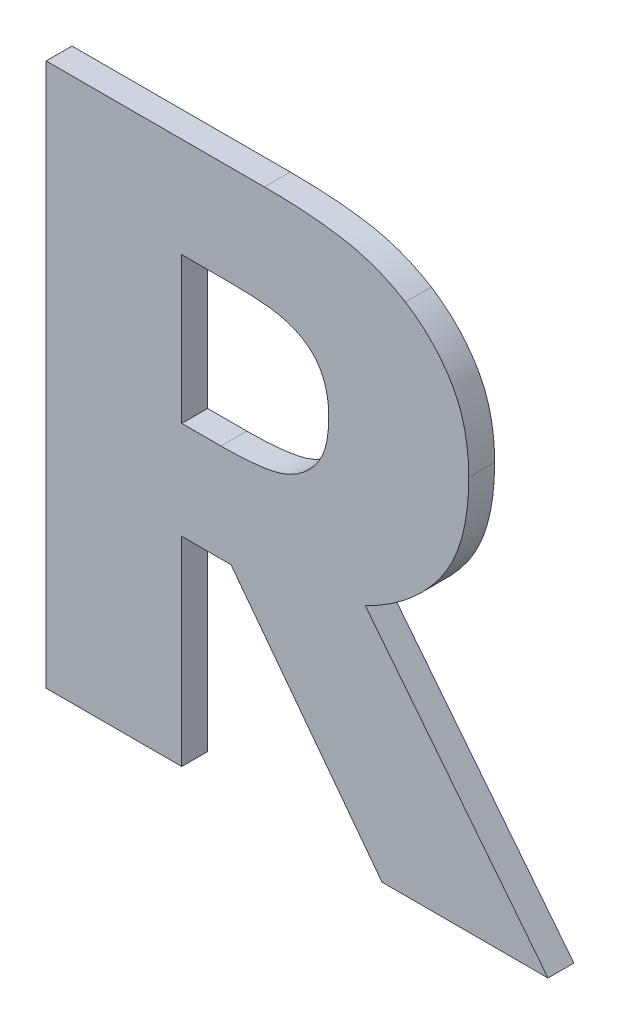
ISO-10303-21;
HEADER;
FILE_DESCRIPTION(('STEP AP214'),'2;1');
FILE_NAME('part.step','',(''),(''),'','','');
FILE_SCHEMA(('AUTOMOTIVE_DESIGN { 1 0 10303 214 1 1 1 1 }'));
ENDSEC;
DATA;
#1=APPLICATION_CONTEXT('core data for automotive mechanical design processes');
#2=APPLICATION_PROTOCOL_DEFINITION('international standard','automotive_design',2000,#1);
#3=PRODUCT_CONTEXT('',#1,'mechanical');
#4=PRODUCT('Part','Part','',(#3));
#5=PRODUCT_RELATED_PRODUCT_CATEGORY('part','',(#4));
#6=PRODUCT_DEFINITION_FORMATION('','',#4);
#7=PRODUCT_DEFINITION_CONTEXT('part definition',#1,'design');
#8=PRODUCT_DEFINITION('design','',#6,#7);
#9=PRODUCT_DEFINITION_SHAPE('','',#8);
#10=(LENGTH_UNIT() NAMED_UNIT(*) SI_UNIT(.MILLI.,.METRE.));
#11=(NAMED_UNIT(*) PLANE_ANGLE_UNIT() SI_UNIT($,.RADIAN.));
#12=(NAMED_UNIT(*) SI_UNIT($,.STERADIAN.) SOLID_ANGLE_UNIT());
#13=UNCERTAINTY_MEASURE_WITH_UNIT(LENGTH_MEASURE(1.E-05),#10,'distance_accuracy_value','');
#14=(GEOMETRIC_REPRESENTATION_CONTEXT(3) GLOBAL_UNCERTAINTY_ASSIGNED_CONTEXT((#13)) GLOBAL_UNIT_ASSIGNED_CONTEXT((#10,
#11,#12)) REPRESENTATION_CONTEXT('',''));
#15=CARTESIAN_POINT('',(0.,0.,0.));
#16=DIRECTION('',(0.,0.,1.));
#17=DIRECTION('',(1.,0.,0.));
#18=AXIS2_PLACEMENT_3D('',#15,#16,#17);
#19=CARTESIAN_POINT('',(3.8390123868986,-3.1245842210898,0.0475));
#20=CARTESIAN_POINT('',(3.8390123868986,-3.1245842210898,0.0525));
#21=CARTESIAN_POINT('',(3.8415650610491,-3.1225420817694,0.0475));
#22=CARTESIAN_POINT('',(3.8415650610491,-3.1225420817694,0.0525));
#23=CARTESIAN_POINT('',(3.8440326460612,-3.1170963769151,0.0475));
#24=CARTESIAN_POINT('',(3.8440326460612,-3.1170963769151,0.0525));
#25=CARTESIAN_POINT('',(3.8440326460612,-3.112671741721,0.0475));
#26=CARTESIAN_POINT('',(3.8440326460612,-3.112671741721,0.0525));
#27=B_SPLINE_SURFACE_WITH_KNOTS('',2,1,((#19,#20),(#21,#22),(#23,#24),(#25,#26)),.UNSPECIFIED.,
.F.,.F.,.F.,(3,1,3),(2,2),(0.,1.,2.),(0.,0.01),.UNSPECIFIED.);
#28=CARTESIAN_POINT('',(3.8390123868986,-3.1245842210898,0.0475));
#29=CARTESIAN_POINT('',(3.8415650610491,-3.1225420817694,0.0475));
#30=CARTESIAN_POINT('',(3.8440326460612,-3.1170963769151,0.0475));
#31=CARTESIAN_POINT('',(3.8440326460612,-3.112671741721,0.0475));
#32=B_SPLINE_CURVE_WITH_KNOTS('',2,(#28,#29,#30,#31),.UNSPECIFIED.,.F.,.F.,(3,1,3),(0.,1.,2.),.UNSPECIFIED.);
#33=CARTESIAN_POINT('',(3.8390123868986,-3.1245842210898,0.0475));
#34=VERTEX_POINT('',#33);
#35=CARTESIAN_POINT('',(3.8440326460612,-3.112671741721,0.0475));
#36=VERTEX_POINT('',#35);
#37=EDGE_CURVE('E11',#34,#36,#32,.T.);
#38=DIRECTION('',(0.,0.,1.));
#39=VECTOR('',#38,1.);
#40=CARTESIAN_POINT('',(3.8390123868986,-3.1245842210898,0.0475));
#41=LINE('',#40,#39);
#42=CARTESIAN_POINT('',(3.8390123868986,-3.1245842210898,0.0525));
#43=VERTEX_POINT('',#42);
#44=EDGE_CURVE('E28',#34,#43,#41,.T.);
#45=CARTESIAN_POINT('',(3.8440326460612,-3.112671741721,0.0525));
#46=CARTESIAN_POINT('',(3.8440326460612,-3.1170963769151,0.0525));
#47=CARTESIAN_POINT('',(3.8415650610491,-3.1225420817694,0.0525));
#48=CARTESIAN_POINT('',(3.8390123868986,-3.1245842210898,0.0525));
#49=B_SPLINE_CURVE_WITH_KNOTS('',2,(#45,#46,#47,#48),.UNSPECIFIED.,.F.,.F.,(3,1,3),(-2.,-1.,0.),.UNSPECIFIED.);
#50=CARTESIAN_POINT('',(3.8440326460612,-3.112671741721,0.0525));
#51=VERTEX_POINT('',#50);
#52=EDGE_CURVE('E351',#51,#43,#49,.T.);
#53=DIRECTION('',(0.,0.,1.));
#54=VECTOR('',#53,1.);
#55=CARTESIAN_POINT('',(3.8440326460612,-3.112671741721,0.0475));
#56=LINE('',#55,#54);
#57=EDGE_CURVE('E41',#36,#51,#56,.T.);
#58=ORIENTED_EDGE('',*,*,#37,.F.);
#59=ORIENTED_EDGE('',*,*,#44,.T.);
#60=ORIENTED_EDGE('',*,*,#52,.F.);
#61=ORIENTED_EDGE('',*,*,#57,.F.);
#62=EDGE_LOOP('',(#58,#59,#60,#61));
#63=FACE_BOUND('',#62,.T.);
#64=ADVANCED_FACE('F17',(#63),#27,.F.);
#65=CARTESIAN_POINT('',(3.8231858071659,-3.128072875762,0.0475));
#66=CARTESIAN_POINT('',(3.8231858071659,-3.128072875762,0.0525));
#67=CARTESIAN_POINT('',(3.8286315120202,-3.128072875762,0.0475));
#68=CARTESIAN_POINT('',(3.8286315120202,-3.128072875762,0.0525));
#69=CARTESIAN_POINT('',(3.8363746236098,-3.1267114495485,0.0475));
#70=CARTESIAN_POINT('',(3.8363746236098,-3.1267114495485,0.0525));
#71=CARTESIAN_POINT('',(3.8390123868986,-3.1245842210898,0.0475));
#72=CARTESIAN_POINT('',(3.8390123868986,-3.1245842210898,0.0525));
#73=B_SPLINE_SURFACE_WITH_KNOTS('',2,1,((#65,#66),(#67,#68),(#69,#70),(#71,#72)),.UNSPECIFIED.,
.F.,.F.,.F.,(3,1,3),(2,2),(0.,1.,2.),(0.,0.01),.UNSPECIFIED.);
#74=CARTESIAN_POINT('',(3.8231858071659,-3.128072875762,0.0475));
#75=CARTESIAN_POINT('',(3.8286315120202,-3.128072875762,0.0475));
#76=CARTESIAN_POINT('',(3.8363746236098,-3.1267114495485,0.0475));
#77=CARTESIAN_POINT('',(3.8390123868986,-3.1245842210898,0.0475));
#78=B_SPLINE_CURVE_WITH_KNOTS('',2,(#74,#75,#76,#77),.UNSPECIFIED.,.F.,.F.,(3,1,3),(0.,1.,2.),.UNSPECIFIED.);
#79=CARTESIAN_POINT('',(3.8231858071659,-3.128072875762,0.0475));
#80=VERTEX_POINT('',#79);
#81=EDGE_CURVE('E342',#80,#34,#78,.T.);
#82=DIRECTION('',(0.,0.,1.));
#83=VECTOR('',#82,1.);
#84=CARTESIAN_POINT('',(3.8231858071659,-3.128072875762,0.0475));
#85=LINE('',#84,#83);
#86=CARTESIAN_POINT('',(3.8231858071659,-3.128072875762,0.0525));
#87=VERTEX_POINT('',#86);
#88=EDGE_CURVE('E336',#80,#87,#85,.T.);
#89=CARTESIAN_POINT('',(3.8390123868986,-3.1245842210898,0.0525));
#90=CARTESIAN_POINT('',(3.8363746236098,-3.1267114495485,0.0525));
#91=CARTESIAN_POINT('',(3.8286315120202,-3.128072875762,0.0525));
#92=CARTESIAN_POINT('',(3.8231858071659,-3.128072875762,0.0525));
#93=B_SPLINE_CURVE_WITH_KNOTS('',2,(#89,#90,#91,#92),.UNSPECIFIED.,.F.,.F.,(3,1,3),(-2.,-1.,0.),.UNSPECIFIED.);
#94=EDGE_CURVE('E332',#43,#87,#93,.T.);
#95=ORIENTED_EDGE('',*,*,#81,.F.);
#96=ORIENTED_EDGE('',*,*,#88,.T.);
#97=ORIENTED_EDGE('',*,*,#94,.F.);
#98=ORIENTED_EDGE('',*,*,#44,.F.);
#99=EDGE_LOOP('',(#95,#96,#97,#98));
#100=FACE_BOUND('',#99,.T.);
#101=ADVANCED_FACE('F357',(#100),#73,.F.);
#102=CARTESIAN_POINT('',(3.8156128738529,-3.128072875762,0.0475));
#103=DIRECTION('',(0.,-1.,0.));
#104=DIRECTION('',(1.,0.,0.));
#105=AXIS2_PLACEMENT_3D('',#102,#103,#104);
#106=PLANE('',#105);
#107=DIRECTION('',(1.,0.,0.));
#108=VECTOR('',#107,1.);
#109=CARTESIAN_POINT('',(3.8223830287598,-3.128072875762,0.0475));
#110=LINE('',#109,#108);
#111=CARTESIAN_POINT('',(3.8156128738529,-3.128072875762,0.0475));
#112=VERTEX_POINT('',#111);
#113=EDGE_CURVE('E329',#112,#80,#110,.T.);
#114=ORIENTED_EDGE('',*,*,#113,.F.);
#115=DIRECTION('',(0.,0.,1.));
#116=VECTOR('',#115,1.);
#117=CARTESIAN_POINT('',(3.8156128738529,-3.128072875762,0.0475));
#118=LINE('',#117,#116);
#119=CARTESIAN_POINT('',(3.8156128738529,-3.128072875762,0.0525));
#120=VERTEX_POINT('',#119);
#121=EDGE_CURVE('E327',#112,#120,#118,.T.);
#122=ORIENTED_EDGE('',*,*,#121,.T.);
#123=DIRECTION('',(-1.,0.,0.));
#124=VECTOR('',#123,1.);
#125=CARTESIAN_POINT('',(3.8223830287598,-3.128072875762,0.0525));
#126=LINE('',#125,#124);
#127=EDGE_CURVE('E324',#87,#120,#126,.T.);
#128=ORIENTED_EDGE('',*,*,#127,.F.);
#129=ORIENTED_EDGE('',*,*,#88,.F.);
#130=EDGE_LOOP('',(#114,#122,#128,#129));
#131=FACE_BOUND('',#130,.T.);
#132=ADVANCED_FACE('F370',(#131),#106,.F.);
#133=CARTESIAN_POINT('',(3.8156128738529,-3.0998232818304,0.0475));
#134=DIRECTION('',(-1.,0.,0.));
#135=DIRECTION('',(0.,-1.,0.));
#136=AXIS2_PLACEMENT_3D('',#133,#134,#135);
#137=PLANE('',#136);
#138=DIRECTION('',(0.,-1.,0.));
#139=VECTOR('',#138,1.);
#140=CARTESIAN_POINT('',(3.8156128738529,-3.1205726167711,0.0475));
#141=LINE('',#140,#139);
#142=CARTESIAN_POINT('',(3.8156128738529,-3.0998232818304,0.0475));
#143=VERTEX_POINT('',#142);
#144=EDGE_CURVE('E321',#143,#112,#141,.T.);
#145=ORIENTED_EDGE('',*,*,#144,.F.);
#146=DIRECTION('',(0.,0.,1.));
#147=VECTOR('',#146,1.);
#148=CARTESIAN_POINT('',(3.8156128738529,-3.0998232818304,0.0475));
#149=LINE('',#148,#147);
#150=CARTESIAN_POINT('',(3.8156128738529,-3.0998232818304,0.0525));
#151=VERTEX_POINT('',#150);
#152=EDGE_CURVE('E319',#143,#151,#149,.T.);
#153=ORIENTED_EDGE('',*,*,#152,.T.);
#154=DIRECTION('',(0.,1.,0.));
#155=VECTOR('',#154,1.);
#156=CARTESIAN_POINT('',(3.8156128738529,-3.1205726167711,0.0525));
#157=LINE('',#156,#155);
#158=EDGE_CURVE('E316',#120,#151,#157,.T.);
#159=ORIENTED_EDGE('',*,*,#158,.F.);
#160=ORIENTED_EDGE('',*,*,#121,.F.);
#161=EDGE_LOOP('',(#145,#153,#159,#160));
#162=FACE_BOUND('',#161,.T.);
#163=ADVANCED_FACE('F372',(#162),#137,.F.);
#164=CARTESIAN_POINT('',(3.8244621442411,-3.0998232818304,0.0475));
#165=DIRECTION('',(0.,1.,0.));
#166=DIRECTION('',(-1.,0.,0.));
#167=AXIS2_PLACEMENT_3D('',#164,#165,#166);
#168=PLANE('',#167);
#169=DIRECTION('',(-1.,0.,0.));
#170=VECTOR('',#169,1.);
#171=CARTESIAN_POINT('',(3.8268076639539,-3.0998232818304,0.0475));
#172=LINE('',#171,#170);
#173=CARTESIAN_POINT('',(3.8244621442411,-3.0998232818304,0.0475));
#174=VERTEX_POINT('',#173);
#175=EDGE_CURVE('E313',#174,#143,#172,.T.);
#176=ORIENTED_EDGE('',*,*,#175,.F.);
#177=DIRECTION('',(0.,0.,1.));
#178=VECTOR('',#177,1.);
#179=CARTESIAN_POINT('',(3.8244621442411,-3.0998232818304,0.0475));
#180=LINE('',#179,#178);
#181=CARTESIAN_POINT('',(3.8244621442411,-3.0998232818304,0.0525));
#182=VERTEX_POINT('',#181);
#183=EDGE_CURVE('E311',#174,#182,#180,.T.);
#184=ORIENTED_EDGE('',*,*,#183,.T.);
#185=DIRECTION('',(1.,0.,0.));
#186=VECTOR('',#185,1.);
#187=CARTESIAN_POINT('',(3.8268076639539,-3.0998232818304,0.0525));
#188=LINE('',#187,#186);
#189=EDGE_CURVE('E305',#151,#182,#188,.T.);
#190=ORIENTED_EDGE('',*,*,#189,.F.);
#191=ORIENTED_EDGE('',*,*,#152,.F.);
#192=EDGE_LOOP('',(#176,#184,#190,#191));
#193=FACE_BOUND('',#192,.T.);
#194=ADVANCED_FACE('F376',(#193),#168,.F.);
#195=CARTESIAN_POINT('',(3.8374807824084,-3.101439975459,0.0475));
#196=CARTESIAN_POINT('',(3.8374807824084,-3.101439975459,0.0525));
#197=CARTESIAN_POINT('',(3.8350131973963,-3.1004189057989,0.0475));
#198=CARTESIAN_POINT('',(3.8350131973963,-3.1004189057989,0.0525));
#199=CARTESIAN_POINT('',(3.8289718685735,-3.0998232818304,0.0475));
#200=CARTESIAN_POINT('',(3.8289718685735,-3.0998232818304,0.0525));
#201=CARTESIAN_POINT('',(3.8244621442411,-3.0998232818304,0.0475));
#202=CARTESIAN_POINT('',(3.8244621442411,-3.0998232818304,0.0525));
#203=B_SPLINE_SURFACE_WITH_KNOTS('',2,1,((#195,#196),(#197,#198),(#199,#200),(#201,#202)),
.UNSPECIFIED.,.F.,.F.,.F.,(3,1,3),(2,2),(0.,1.,2.),(0.,0.01),.UNSPECIFIED.);
#204=CARTESIAN_POINT('',(3.8374807824084,-3.101439975459,0.0475));
#205=CARTESIAN_POINT('',(3.8350131973963,-3.1004189057989,0.0475));
#206=CARTESIAN_POINT('',(3.8289718685735,-3.0998232818304,0.0475));
#207=CARTESIAN_POINT('',(3.8244621442411,-3.0998232818304,0.0475));
#208=B_SPLINE_CURVE_WITH_KNOTS('',2,(#204,#205,#206,#207),.UNSPECIFIED.,.F.,.F.,(3,1,3),(0.,1.,
2.),.UNSPECIFIED.);
#209=CARTESIAN_POINT('',(3.8374807824084,-3.101439975459,0.0475));
#210=VERTEX_POINT('',#209);
#211=EDGE_CURVE('E300',#210,#174,#208,.T.);
#212=DIRECTION('',(0.,0.,1.));
#213=VECTOR('',#212,1.);
#214=CARTESIAN_POINT('',(3.8374807824084,-3.101439975459,0.0475));
#215=LINE('',#214,#213);
#216=CARTESIAN_POINT('',(3.8374807824084,-3.101439975459,0.0525));
#217=VERTEX_POINT('',#216);
#218=EDGE_CURVE('E294',#210,#217,#215,.T.);
#219=CARTESIAN_POINT('',(3.8244621442411,-3.0998232818304,0.0525));
#220=CARTESIAN_POINT('',(3.8289718685735,-3.0998232818304,0.0525));
#221=CARTESIAN_POINT('',(3.8350131973963,-3.1004189057989,0.0525));
#222=CARTESIAN_POINT('',(3.8374807824084,-3.101439975459,0.0525));
#223=B_SPLINE_CURVE_WITH_KNOTS('',2,(#219,#220,#221,#222),.UNSPECIFIED.,.F.,.F.,(3,1,3),(-2.,
-1.,0.),.UNSPECIFIED.);
#224=EDGE_CURVE('E287',#182,#217,#223,.T.);
#225=ORIENTED_EDGE('',*,*,#211,.F.);
#226=ORIENTED_EDGE('',*,*,#218,.T.);
#227=ORIENTED_EDGE('',*,*,#224,.F.);
#228=ORIENTED_EDGE('',*,*,#183,.F.);
#229=EDGE_LOOP('',(#225,#226,#227,#228));
#230=FACE_BOUND('',#229,.T.);
#231=ADVANCED_FACE('F379',(#230),#203,.F.);
#232=CARTESIAN_POINT('',(3.8440326460612,-3.112671741721,0.0475));
#233=CARTESIAN_POINT('',(3.8440326460612,-3.112671741721,0.0525));
#234=CARTESIAN_POINT('',(3.8440326460612,-3.1086725522186,0.0475));
#235=CARTESIAN_POINT('',(3.8440326460612,-3.1086725522186,0.0525));
#236=CARTESIAN_POINT('',(3.8409694370807,-3.1029715799493,0.0475));
#237=CARTESIAN_POINT('',(3.8409694370807,-3.1029715799493,0.0525));
#238=CARTESIAN_POINT('',(3.8374807824084,-3.101439975459,0.0475));
#239=CARTESIAN_POINT('',(3.8374807824084,-3.101439975459,0.0525));
#240=B_SPLINE_SURFACE_WITH_KNOTS('',2,1,((#232,#233),(#234,#235),(#236,#237),(#238,#239)),
.UNSPECIFIED.,.F.,.F.,.F.,(3,1,3),(2,2),(0.,1.,2.),(0.,0.01),.UNSPECIFIED.);
#241=CARTESIAN_POINT('',(3.8440326460612,-3.112671741721,0.0475));
#242=CARTESIAN_POINT('',(3.8440326460612,-3.1086725522186,0.0475));
#243=CARTESIAN_POINT('',(3.8409694370807,-3.1029715799493,0.0475));
#244=CARTESIAN_POINT('',(3.8374807824084,-3.101439975459,0.0475));
#245=B_SPLINE_CURVE_WITH_KNOTS('',2,(#241,#242,#243,#244),.UNSPECIFIED.,.F.,.F.,(3,1,3),(0.,1.,
2.),.UNSPECIFIED.);
#246=EDGE_CURVE('E279',#36,#210,#245,.T.);
#247=CARTESIAN_POINT('',(3.8374807824084,-3.101439975459,0.0525));
#248=CARTESIAN_POINT('',(3.8409694370807,-3.1029715799493,0.0525));
#249=CARTESIAN_POINT('',(3.8440326460612,-3.1086725522186,0.0525));
#250=CARTESIAN_POINT('',(3.8440326460612,-3.112671741721,0.0525));
#251=B_SPLINE_CURVE_WITH_KNOTS('',2,(#247,#248,#249,#250),.UNSPECIFIED.,.F.,.F.,(3,1,3),(-2.,
-1.,0.),.UNSPECIFIED.);
#252=EDGE_CURVE('E274',#217,#51,#251,.T.);
#253=ORIENTED_EDGE('',*,*,#246,.F.);
#254=ORIENTED_EDGE('',*,*,#57,.T.);
#255=ORIENTED_EDGE('',*,*,#252,.F.);
#256=ORIENTED_EDGE('',*,*,#218,.F.);
#257=EDGE_LOOP('',(#253,#254,#255,#256));
#258=FACE_BOUND('',#257,.T.);
#259=ADVANCED_FACE('F364',(#258),#240,.F.);
#260=CARTESIAN_POINT('',(3.8251428573479,-3.1469626644753,0.0475));
#261=DIRECTION('',(-0.797246141356458,-0.60365436310213,0.));
#262=DIRECTION('',(0.60365436310213,-0.797246141356458,0.));
#263=AXIS2_PLACEMENT_3D('',#260,#261,#262);
#264=PLANE('',#263);
#265=DIRECTION('',(-0.60365436310213,0.797246141356458,0.));
#266=VECTOR('',#265,1.);
#267=CARTESIAN_POINT('',(3.8543284318013,-3.1855080441471,0.0475));
#268=LINE('',#267,#266);
#269=CARTESIAN_POINT('',(3.8543284318013,-3.1855080441471,0.0475));
#270=VERTEX_POINT('',#269);
#271=CARTESIAN_POINT('',(3.8251428573479,-3.1469626644753,0.0475));
#272=VERTEX_POINT('',#271);
#273=EDGE_CURVE('E272',#270,#272,#268,.T.);
#274=ORIENTED_EDGE('',*,*,#273,.F.);
#275=DIRECTION('',(0.,0.,1.));
#276=VECTOR('',#275,1.);
#277=CARTESIAN_POINT('',(3.8543284318013,-3.1855080441471,0.0475));
#278=LINE('',#277,#276);
#279=CARTESIAN_POINT('',(3.8543284318013,-3.1855080441471,0.0525));
#280=VERTEX_POINT('',#279);
#281=EDGE_CURVE('E270',#270,#280,#278,.T.);
#282=ORIENTED_EDGE('',*,*,#281,.T.);
#283=DIRECTION('',(0.60365436310213,-0.797246141356458,0.));
#284=VECTOR('',#283,1.);
#285=CARTESIAN_POINT('',(3.8543284318013,-3.1855080441471,0.0525));
#286=LINE('',#285,#284);
#287=CARTESIAN_POINT('',(3.8251428573479,-3.1469626644753,0.0525));
#288=VERTEX_POINT('',#287);
#289=EDGE_CURVE('E171',#288,#280,#286,.T.);
#290=ORIENTED_EDGE('',*,*,#289,.F.);
#291=DIRECTION('',(0.,0.,1.));
#292=VECTOR('',#291,1.);
#293=CARTESIAN_POINT('',(3.8251428573479,-3.1469626644753,0.0475));
#294=LINE('',#293,#292);
#295=EDGE_CURVE('E266',#272,#288,#294,.T.);
#296=ORIENTED_EDGE('',*,*,#295,.F.);
#297=EDGE_LOOP('',(#274,#282,#290,#296));
#298=FACE_BOUND('',#297,.T.);
#299=ADVANCED_FACE('F387',(#298),#264,.T.);
#300=CARTESIAN_POINT('',(3.8156128738529,-3.1469626644753,0.0475));
#301=DIRECTION('',(0.,-1.,0.));
#302=DIRECTION('',(1.,0.,0.));
#303=AXIS2_PLACEMENT_3D('',#300,#301,#302);
#304=PLANE('',#303);
#305=DIRECTION('',(-1.,0.,0.));
#306=VECTOR('',#305,1.);
#307=CARTESIAN_POINT('',(3.8251428573479,-3.1469626644753,0.0475));
#308=LINE('',#307,#306);
#309=CARTESIAN_POINT('',(3.8156128738529,-3.1469626644753,0.0475));
#310=VERTEX_POINT('',#309);
#311=EDGE_CURVE('E264',#272,#310,#308,.T.);
#312=ORIENTED_EDGE('',*,*,#311,.F.);
#313=ORIENTED_EDGE('',*,*,#295,.T.);
#314=DIRECTION('',(1.,0.,0.));
#315=VECTOR('',#314,1.);
#316=CARTESIAN_POINT('',(3.8251428573479,-3.1469626644753,0.0525));
#317=LINE('',#316,#315);
#318=CARTESIAN_POINT('',(3.8156128738529,-3.1469626644753,0.0525));
#319=VERTEX_POINT('',#318);
#320=EDGE_CURVE('E262',#319,#288,#317,.T.);
#321=ORIENTED_EDGE('',*,*,#320,.F.);
#322=DIRECTION('',(0.,0.,1.));
#323=VECTOR('',#322,1.);
#324=CARTESIAN_POINT('',(3.8156128738529,-3.1469626644753,0.0475));
#325=LINE('',#324,#323);
#326=EDGE_CURVE('E259',#310,#319,#325,.T.);
#327=ORIENTED_EDGE('',*,*,#326,.F.);
#328=EDGE_LOOP('',(#312,#313,#321,#327));
#329=FACE_BOUND('',#328,.T.);
#330=ADVANCED_FACE('F441',(#329),#304,.T.);
#331=CARTESIAN_POINT('',(3.8156128738529,-3.1855080441471,0.0475));
#332=DIRECTION('',(1.,0.,0.));
#333=DIRECTION('',(0.,1.,0.));
#334=AXIS2_PLACEMENT_3D('',#331,#332,#333);
#335=PLANE('',#334);
#336=DIRECTION('',(0.,-1.,0.));
#337=VECTOR('',#336,1.);
#338=CARTESIAN_POINT('',(3.8156128738529,-3.1469626644753,0.0475));
#339=LINE('',#338,#337);
#340=CARTESIAN_POINT('',(3.8156128738529,-3.1855080441471,0.0475));
#341=VERTEX_POINT('',#340);
#342=EDGE_CURVE('E257',#310,#341,#339,.T.);
#343=ORIENTED_EDGE('',*,*,#342,.F.);
#344=ORIENTED_EDGE('',*,*,#326,.T.);
#345=DIRECTION('',(0.,1.,0.));
#346=VECTOR('',#345,1.);
#347=CARTESIAN_POINT('',(3.8156128738529,-3.1469626644753,0.0525));
#348=LINE('',#347,#346);
#349=CARTESIAN_POINT('',(3.8156128738529,-3.1855080441471,0.0525));
#350=VERTEX_POINT('',#349);
#351=EDGE_CURVE('E254',#350,#319,#348,.T.);
#352=ORIENTED_EDGE('',*,*,#351,.F.);
#353=DIRECTION('',(0.,0.,1.));
#354=VECTOR('',#353,1.);
#355=CARTESIAN_POINT('',(3.8156128738529,-3.1855080441471,0.0475));
#356=LINE('',#355,#354);
#357=EDGE_CURVE('E251',#341,#350,#356,.T.);
#358=ORIENTED_EDGE('',*,*,#357,.F.);
#359=EDGE_LOOP('',(#343,#344,#352,#358));
#360=FACE_BOUND('',#359,.T.);
#361=ADVANCED_FACE('F451',(#360),#335,.T.);
#362=CARTESIAN_POINT('',(3.7894054192416,-3.1855080441471,0.0475));
#363=DIRECTION('',(0.,-1.,0.));
#364=DIRECTION('',(1.,0.,0.));
#365=AXIS2_PLACEMENT_3D('',#362,#363,#364);
#366=PLANE('',#365);
#367=DIRECTION('',(-1.,0.,0.));
#368=VECTOR('',#367,1.);
#369=CARTESIAN_POINT('',(3.8156128738529,-3.1855080441471,0.0475));
#370=LINE('',#369,#368);
#371=CARTESIAN_POINT('',(3.7894054192416,-3.1855080441471,0.0475));
#372=VERTEX_POINT('',#371);
#373=EDGE_CURVE('E249',#341,#372,#370,.T.);
#374=ORIENTED_EDGE('',*,*,#373,.F.);
#375=ORIENTED_EDGE('',*,*,#357,.T.);
#376=DIRECTION('',(1.,0.,0.));
#377=VECTOR('',#376,1.);
#378=CARTESIAN_POINT('',(3.8156128738529,-3.1855080441471,0.0525));
#379=LINE('',#378,#377);
#380=CARTESIAN_POINT('',(3.7894054192416,-3.1855080441471,0.0525));
#381=VERTEX_POINT('',#380);
#382=EDGE_CURVE('E246',#381,#350,#379,.T.);
#383=ORIENTED_EDGE('',*,*,#382,.F.);
#384=DIRECTION('',(0.,0.,1.));
#385=VECTOR('',#384,1.);
#386=CARTESIAN_POINT('',(3.7894054192416,-3.1855080441471,0.0475));
#387=LINE('',#386,#385);
#388=EDGE_CURVE('E243',#372,#381,#387,.T.);
#389=ORIENTED_EDGE('',*,*,#388,.F.);
#390=EDGE_LOOP('',(#374,#375,#383,#389));
#391=FACE_BOUND('',#390,.T.);
#392=ADVANCED_FACE('F461',(#391),#366,.T.);
#393=CARTESIAN_POINT('',(3.7894054192416,-3.0805080474254,0.0475));
#394=DIRECTION('',(-1.,0.,0.));
#395=DIRECTION('',(0.,-1.,0.));
#396=AXIS2_PLACEMENT_3D('',#393,#394,#395);
#397=PLANE('',#396);
#398=DIRECTION('',(0.,1.,0.));
#399=VECTOR('',#398,1.);
#400=CARTESIAN_POINT('',(3.7894054192416,-3.1855080441471,0.0475));
#401=LINE('',#400,#399);
#402=CARTESIAN_POINT('',(3.7894054192416,-3.0805080474254,0.0475));
#403=VERTEX_POINT('',#402);
#404=EDGE_CURVE('E241',#372,#403,#401,.T.);
#405=ORIENTED_EDGE('',*,*,#404,.F.);
#406=ORIENTED_EDGE('',*,*,#388,.T.);
#407=DIRECTION('',(0.,-1.,0.));
#408=VECTOR('',#407,1.);
#409=CARTESIAN_POINT('',(3.7894054192416,-3.1855080441471,0.0525));
#410=LINE('',#409,#408);
#411=CARTESIAN_POINT('',(3.7894054192416,-3.0805080474254,0.0525));
#412=VERTEX_POINT('',#411);
#413=EDGE_CURVE('E238',#412,#381,#410,.T.);
#414=ORIENTED_EDGE('',*,*,#413,.F.);
#415=DIRECTION('',(0.,0.,1.));
#416=VECTOR('',#415,1.);
#417=CARTESIAN_POINT('',(3.7894054192416,-3.0805080474254,0.0475));
#418=LINE('',#417,#416);
#419=EDGE_CURVE('E235',#403,#412,#418,.T.);
#420=ORIENTED_EDGE('',*,*,#419,.F.);
#421=EDGE_LOOP('',(#405,#406,#414,#420));
#422=FACE_BOUND('',#421,.T.);
#423=ADVANCED_FACE('F471',(#422),#397,.T.);
#424=CARTESIAN_POINT('',(3.8316096318623,-3.0805080474254,0.0475));
#425=DIRECTION('',(0.,1.,0.));
#426=DIRECTION('',(-1.,0.,0.));
#427=AXIS2_PLACEMENT_3D('',#424,#425,#426);
#428=PLANE('',#427);
#429=DIRECTION('',(1.,0.,0.));
#430=VECTOR('',#429,1.);
#431=CARTESIAN_POINT('',(3.7894054192416,-3.0805080474254,0.0475));
#432=LINE('',#431,#430);
#433=CARTESIAN_POINT('',(3.8316096318623,-3.0805080474254,0.0475));
#434=VERTEX_POINT('',#433);
#435=EDGE_CURVE('E233',#403,#434,#432,.T.);
#436=ORIENTED_EDGE('',*,*,#435,.F.);
#437=ORIENTED_EDGE('',*,*,#419,.T.);
#438=DIRECTION('',(-1.,0.,0.));
#439=VECTOR('',#438,1.);
#440=CARTESIAN_POINT('',(3.7894054192416,-3.0805080474254,0.0525));
#441=LINE('',#440,#439);
#442=CARTESIAN_POINT('',(3.8316096318623,-3.0805080474254,0.0525));
#443=VERTEX_POINT('',#442);
#444=EDGE_CURVE('E230',#443,#412,#441,.T.);
#445=ORIENTED_EDGE('',*,*,#444,.F.);
#446=DIRECTION('',(0.,0.,1.));
#447=VECTOR('',#446,1.);
#448=CARTESIAN_POINT('',(3.8316096318623,-3.0805080474254,0.0475));
#449=LINE('',#448,#447);
#450=EDGE_CURVE('E224',#434,#443,#449,.T.);
#451=ORIENTED_EDGE('',*,*,#450,.F.);
#452=EDGE_LOOP('',(#436,#437,#445,#451));
#453=FACE_BOUND('',#452,.T.);
#454=ADVANCED_FACE('F481',(#453),#428,.T.);
#455=CARTESIAN_POINT('',(3.8588381561338,-3.0861239305563,0.0475));
#456=CARTESIAN_POINT('',(3.8588381561338,-3.0861239305563,0.0525));
#457=CARTESIAN_POINT('',(3.8533073621412,-3.0827203650224,0.0475));
#458=CARTESIAN_POINT('',(3.8533073621412,-3.0827203650224,0.0525));
#459=CARTESIAN_POINT('',(3.8403738131122,-3.0805080474254,0.0475));
#460=CARTESIAN_POINT('',(3.8403738131122,-3.0805080474254,0.0525));
#461=CARTESIAN_POINT('',(3.8316096318623,-3.0805080474254,0.0475));
#462=CARTESIAN_POINT('',(3.8316096318623,-3.0805080474254,0.0525));
#463=B_SPLINE_SURFACE_WITH_KNOTS('',2,1,((#455,#456),(#457,#458),(#459,#460),(#461,#462)),
.UNSPECIFIED.,.F.,.F.,.F.,(3,1,3),(2,2),(-2.,-1.,0.),(0.,0.01),.UNSPECIFIED.);
#464=CARTESIAN_POINT('',(3.8316096318623,-3.0805080474254,0.0475));
#465=CARTESIAN_POINT('',(3.8403738131122,-3.0805080474254,0.0475));
#466=CARTESIAN_POINT('',(3.8533073621412,-3.0827203650224,0.0475));
#467=CARTESIAN_POINT('',(3.8588381561338,-3.0861239305563,0.0475));
#468=B_SPLINE_CURVE_WITH_KNOTS('',2,(#464,#465,#466,#467),.UNSPECIFIED.,.F.,.F.,(3,1,3),(0.,1.,
2.),.UNSPECIFIED.);
#469=CARTESIAN_POINT('',(3.8588381561338,-3.0861239305563,0.0475));
#470=VERTEX_POINT('',#469);
#471=EDGE_CURVE('E217',#434,#470,#468,.T.);
#472=CARTESIAN_POINT('',(3.8588381561338,-3.0861239305563,0.0525));
#473=CARTESIAN_POINT('',(3.8533073621412,-3.0827203650224,0.0525));
#474=CARTESIAN_POINT('',(3.8403738131122,-3.0805080474254,0.0525));
#475=CARTESIAN_POINT('',(3.8316096318623,-3.0805080474254,0.0525));
#476=B_SPLINE_CURVE_WITH_KNOTS('',2,(#472,#473,#474,#475),.UNSPECIFIED.,.F.,.F.,(3,1,3),(-2.,
-1.,0.),.UNSPECIFIED.);
#477=CARTESIAN_POINT('',(3.8588381561338,-3.0861239305563,0.0525));
#478=VERTEX_POINT('',#477);
#479=EDGE_CURVE('E212',#478,#443,#476,.T.);
#480=DIRECTION('',(0.,0.,1.));
#481=VECTOR('',#480,1.);
#482=CARTESIAN_POINT('',(3.8588381561338,-3.0861239305563,0.0475));
#483=LINE('',#482,#481);
#484=EDGE_CURVE('E206',#470,#478,#483,.T.);
#485=ORIENTED_EDGE('',*,*,#471,.F.);
#486=ORIENTED_EDGE('',*,*,#450,.T.);
#487=ORIENTED_EDGE('',*,*,#479,.F.);
#488=ORIENTED_EDGE('',*,*,#484,.F.);
#489=EDGE_LOOP('',(#485,#486,#487,#488));
#490=FACE_BOUND('',#489,.T.);
#491=ADVANCED_FACE('F491',(#490),#463,.T.);
#492=CARTESIAN_POINT('',(3.8710909920559,-3.1093532653254,0.0475));
#493=CARTESIAN_POINT('',(3.8710909920559,-3.1093532653254,0.0525));
#494=CARTESIAN_POINT('',(3.8710909920559,-3.1008443514906,0.0475));
#495=CARTESIAN_POINT('',(3.8710909920559,-3.1008443514906,0.0525));
#496=CARTESIAN_POINT('',(3.8644540392648,-3.089697674367,0.0475));
#497=CARTESIAN_POINT('',(3.8644540392648,-3.089697674367,0.0525));
#498=CARTESIAN_POINT('',(3.8588381561338,-3.0861239305563,0.0475));
#499=CARTESIAN_POINT('',(3.8588381561338,-3.0861239305563,0.0525));
#500=B_SPLINE_SURFACE_WITH_KNOTS('',2,1,((#492,#493),(#494,#495),(#496,#497),(#498,#499)),
.UNSPECIFIED.,.F.,.F.,.F.,(3,1,3),(2,2),(-2.,-1.,0.),(0.,0.01),.UNSPECIFIED.);
#501=CARTESIAN_POINT('',(3.8588381561338,-3.0861239305563,0.0475));
#502=CARTESIAN_POINT('',(3.8644540392648,-3.089697674367,0.0475));
#503=CARTESIAN_POINT('',(3.8710909920559,-3.1008443514906,0.0475));
#504=CARTESIAN_POINT('',(3.8710909920559,-3.1093532653254,0.0475));
#505=B_SPLINE_CURVE_WITH_KNOTS('',2,(#501,#502,#503,#504),.UNSPECIFIED.,.F.,.F.,(3,1,3),(0.,1.,
2.),.UNSPECIFIED.);
#506=CARTESIAN_POINT('',(3.8710909920559,-3.1093532653254,0.0475));
#507=VERTEX_POINT('',#506);
#508=EDGE_CURVE('E199',#470,#507,#505,.T.);
#509=CARTESIAN_POINT('',(3.8710909920559,-3.1093532653254,0.0525));
#510=CARTESIAN_POINT('',(3.8710909920559,-3.1008443514906,0.0525));
#511=CARTESIAN_POINT('',(3.8644540392648,-3.089697674367,0.0525));
#512=CARTESIAN_POINT('',(3.8588381561338,-3.0861239305563,0.0525));
#513=B_SPLINE_CURVE_WITH_KNOTS('',2,(#509,#510,#511,#512),.UNSPECIFIED.,.F.,.F.,(3,1,3),(-2.,
-1.,0.),.UNSPECIFIED.);
#514=CARTESIAN_POINT('',(3.8710909920559,-3.1093532653254,0.0525));
#515=VERTEX_POINT('',#514);
#516=EDGE_CURVE('E194',#515,#478,#513,.T.);
#517=DIRECTION('',(0.,0.,1.));
#518=VECTOR('',#517,1.);
#519=CARTESIAN_POINT('',(3.8710909920559,-3.1093532653254,0.0475));
#520=LINE('',#519,#518);
#521=EDGE_CURVE('E188',#507,#515,#520,.T.);
#522=ORIENTED_EDGE('',*,*,#508,.F.);
#523=ORIENTED_EDGE('',*,*,#484,.T.);
#524=ORIENTED_EDGE('',*,*,#516,.F.);
#525=ORIENTED_EDGE('',*,*,#521,.F.);
#526=EDGE_LOOP('',(#522,#523,#524,#525));
#527=FACE_BOUND('',#526,.T.);
#528=ADVANCED_FACE('F501',(#527),#500,.T.);
#529=CARTESIAN_POINT('',(3.8510950445441,-3.1408362465143,0.0475));
#530=CARTESIAN_POINT('',(3.8510950445441,-3.1408362465143,0.0525));
#531=CARTESIAN_POINT('',(3.8601995823474,-3.1364116113202,0.0475));
#532=CARTESIAN_POINT('',(3.8601995823474,-3.1364116113202,0.0525));
#533=CARTESIAN_POINT('',(3.8710909920559,-3.1213508338325,0.0475));
#534=CARTESIAN_POINT('',(3.8710909920559,-3.1213508338325,0.0525));
#535=CARTESIAN_POINT('',(3.8710909920559,-3.1093532653254,0.0475));
#536=CARTESIAN_POINT('',(3.8710909920559,-3.1093532653254,0.0525));
#537=B_SPLINE_SURFACE_WITH_KNOTS('',2,1,((#529,#530),(#531,#532),(#533,#534),(#535,#536)),
.UNSPECIFIED.,.F.,.F.,.F.,(3,1,3),(2,2),(-2.,-1.,0.),(0.,0.01),.UNSPECIFIED.);
#538=CARTESIAN_POINT('',(3.8710909920559,-3.1093532653254,0.0475));
#539=CARTESIAN_POINT('',(3.8710909920559,-3.1213508338325,0.0475));
#540=CARTESIAN_POINT('',(3.8601995823474,-3.1364116113202,0.0475));
#541=CARTESIAN_POINT('',(3.8510950445441,-3.1408362465143,0.0475));
#542=B_SPLINE_CURVE_WITH_KNOTS('',2,(#538,#539,#540,#541),.UNSPECIFIED.,.F.,.F.,(3,1,3),(0.,1.,
2.),.UNSPECIFIED.);
#543=CARTESIAN_POINT('',(3.8510950445441,-3.1408362465143,0.0475));
#544=VERTEX_POINT('',#543);
#545=EDGE_CURVE('E181',#507,#544,#542,.T.);
#546=CARTESIAN_POINT('',(3.8510950445441,-3.1408362465143,0.0525));
#547=CARTESIAN_POINT('',(3.8601995823474,-3.1364116113202,0.0525));
#548=CARTESIAN_POINT('',(3.8710909920559,-3.1213508338325,0.0525));
#549=CARTESIAN_POINT('',(3.8710909920559,-3.1093532653254,0.0525));
#550=B_SPLINE_CURVE_WITH_KNOTS('',2,(#546,#547,#548,#549),.UNSPECIFIED.,.F.,.F.,(3,1,3),(-2.,
-1.,0.),.UNSPECIFIED.);
#551=CARTESIAN_POINT('',(3.8510950445441,-3.1408362465143,0.0525));
#552=VERTEX_POINT('',#551);
#553=EDGE_CURVE('E177',#552,#515,#550,.T.);
#554=DIRECTION('',(0.,0.,1.));
#555=VECTOR('',#554,1.);
#556=CARTESIAN_POINT('',(3.8510950445441,-3.1408362465143,0.0475));
#557=LINE('',#556,#555);
#558=EDGE_CURVE('E153',#544,#552,#557,.T.);
#559=ORIENTED_EDGE('',*,*,#545,.F.);
#560=ORIENTED_EDGE('',*,*,#521,.T.);
#561=ORIENTED_EDGE('',*,*,#553,.F.);
#562=ORIENTED_EDGE('',*,*,#558,.F.);
#563=EDGE_LOOP('',(#559,#560,#561,#562));
#564=FACE_BOUND('',#563,.T.);
#565=ADVANCED_FACE('F511',(#564),#537,.T.);
#566=CARTESIAN_POINT('',(3.8864070369586,-3.1855080441471,0.0475));
#567=DIRECTION('',(0.784500119596252,0.620128665966561,0.));
#568=DIRECTION('',(-0.620128665966561,0.784500119596252,0.));
#569=AXIS2_PLACEMENT_3D('',#566,#567,#568);
#570=PLANE('',#569);
#571=DIRECTION('',(0.620128665966561,-0.784500119596252,0.));
#572=VECTOR('',#571,1.);
#573=CARTESIAN_POINT('',(3.8510950445441,-3.1408362465143,0.0475));
#574=LINE('',#573,#572);
#575=CARTESIAN_POINT('',(3.8864070369586,-3.1855080441471,0.0475));
#576=VERTEX_POINT('',#575);
#577=EDGE_CURVE('E157',#544,#576,#574,.T.);
#578=ORIENTED_EDGE('',*,*,#577,.F.);
#579=ORIENTED_EDGE('',*,*,#558,.T.);
#580=DIRECTION('',(-0.620128665966561,0.784500119596252,0.));
#581=VECTOR('',#580,1.);
#582=CARTESIAN_POINT('',(3.8510950445441,-3.1408362465143,0.0525));
#583=LINE('',#582,#581);
#584=CARTESIAN_POINT('',(3.8864070369586,-3.1855080441471,0.0525));
#585=VERTEX_POINT('',#584);
#586=EDGE_CURVE('E146',#585,#552,#583,.T.);
#587=ORIENTED_EDGE('',*,*,#586,.F.);
#588=DIRECTION('',(0.,0.,1.));
#589=VECTOR('',#588,1.);
#590=CARTESIAN_POINT('',(3.8864070369586,-3.1855080441471,0.0475));
#591=LINE('',#590,#589);
#592=EDGE_CURVE('E150',#576,#585,#591,.T.);
#593=ORIENTED_EDGE('',*,*,#592,.F.);
#594=EDGE_LOOP('',(#578,#579,#587,#593));
#595=FACE_BOUND('',#594,.T.);
#596=ADVANCED_FACE('F149',(#595),#570,.T.);
#597=CARTESIAN_POINT('',(3.8543284318013,-3.1855080441471,0.0475));
#598=DIRECTION('',(0.,-1.,0.));
#599=DIRECTION('',(1.,0.,0.));
#600=AXIS2_PLACEMENT_3D('',#597,#598,#599);
#601=PLANE('',#600);
#602=DIRECTION('',(-1.,0.,0.));
#603=VECTOR('',#602,1.);
#604=CARTESIAN_POINT('',(3.8864070369586,-3.1855080441471,0.0475));
#605=LINE('',#604,#603);
#606=EDGE_CURVE('E165',#576,#270,#605,.T.);
#607=ORIENTED_EDGE('',*,*,#606,.F.);
#608=ORIENTED_EDGE('',*,*,#592,.T.);
#609=DIRECTION('',(1.,0.,0.));
#610=VECTOR('',#609,1.);
#611=CARTESIAN_POINT('',(3.8864070369586,-3.1855080441471,0.0525));
#612=LINE('',#611,#610);
#613=EDGE_CURVE('E163',#280,#585,#612,.T.);
#614=ORIENTED_EDGE('',*,*,#613,.F.);
#615=ORIENTED_EDGE('',*,*,#281,.F.);
#616=EDGE_LOOP('',(#607,#608,#614,#615));
#617=FACE_BOUND('',#616,.T.);
#618=ADVANCED_FACE('F161',(#617),#601,.T.);
#619=CARTESIAN_POINT('',(3.8291531836666,-3.1413219517119,0.0475));
#620=DIRECTION('',(0.,0.,1.));
#621=DIRECTION('',(1.,0.,0.));
#622=AXIS2_PLACEMENT_3D('',#619,#620,#621);
#623=PLANE('',#622);
#624=ORIENTED_EDGE('',*,*,#606,.T.);
#625=ORIENTED_EDGE('',*,*,#273,.T.);
#626=ORIENTED_EDGE('',*,*,#311,.T.);
#627=ORIENTED_EDGE('',*,*,#342,.T.);
#628=ORIENTED_EDGE('',*,*,#373,.T.);
#629=ORIENTED_EDGE('',*,*,#404,.T.);
#630=ORIENTED_EDGE('',*,*,#435,.T.);
#631=ORIENTED_EDGE('',*,*,#471,.T.);
#632=ORIENTED_EDGE('',*,*,#508,.T.);
#633=ORIENTED_EDGE('',*,*,#545,.T.);
#634=ORIENTED_EDGE('',*,*,#577,.T.);
#635=EDGE_LOOP('',(#624,#625,#626,#627,#628,#629,#630,#631,#632,#633,#634));
#636=FACE_BOUND('',#635,.T.);
#637=ORIENTED_EDGE('',*,*,#37,.T.);
#638=ORIENTED_EDGE('',*,*,#246,.T.);
#639=ORIENTED_EDGE('',*,*,#211,.T.);
#640=ORIENTED_EDGE('',*,*,#175,.T.);
#641=ORIENTED_EDGE('',*,*,#144,.T.);
#642=ORIENTED_EDGE('',*,*,#113,.T.);
#643=ORIENTED_EDGE('',*,*,#81,.T.);
#644=EDGE_LOOP('',(#637,#638,#639,#640,#641,#642,#643));
#645=FACE_BOUND('',#644,.T.);
#646=ADVANCED_FACE('F367',(#636,#645),#623,.F.);
#647=CARTESIAN_POINT('',(3.8291531836666,-3.1413219517119,0.0525));
#648=DIRECTION('',(0.,0.,1.));
#649=DIRECTION('',(1.,0.,0.));
#650=AXIS2_PLACEMENT_3D('',#647,#648,#649);
#651=PLANE('',#650);
#652=ORIENTED_EDGE('',*,*,#613,.T.);
#653=ORIENTED_EDGE('',*,*,#586,.T.);
#654=ORIENTED_EDGE('',*,*,#553,.T.);
#655=ORIENTED_EDGE('',*,*,#516,.T.);
#656=ORIENTED_EDGE('',*,*,#479,.T.);
#657=ORIENTED_EDGE('',*,*,#444,.T.);
#658=ORIENTED_EDGE('',*,*,#413,.T.);
#659=ORIENTED_EDGE('',*,*,#382,.T.);
#660=ORIENTED_EDGE('',*,*,#351,.T.);
#661=ORIENTED_EDGE('',*,*,#320,.T.);
#662=ORIENTED_EDGE('',*,*,#289,.T.);
#663=EDGE_LOOP('',(#652,#653,#654,#655,#656,#657,#658,#659,#660,#661,#662));
#664=FACE_BOUND('',#663,.T.);
#665=ORIENTED_EDGE('',*,*,#52,.T.);
#666=ORIENTED_EDGE('',*,*,#94,.T.);
#667=ORIENTED_EDGE('',*,*,#127,.T.);
#668=ORIENTED_EDGE('',*,*,#158,.T.);
#669=ORIENTED_EDGE('',*,*,#189,.T.);
#670=ORIENTED_EDGE('',*,*,#224,.T.);
#671=ORIENTED_EDGE('',*,*,#252,.T.);
#672=EDGE_LOOP('',(#665,#666,#667,#668,#669,#670,#671));
#673=FACE_BOUND('',#672,.T.);
#674=ADVANCED_FACE('F168',(#664,#673),#651,.T.);
#675=CLOSED_SHELL('',(#64,#101,#132,#163,#194,#231,#259,#299,#330,#361,#392,#423,#454,#491,#528,
#565,#596,#618,#646,#674));
#676=MANIFOLD_SOLID_BREP('B1',#675);
#677=ADVANCED_BREP_SHAPE_REPRESENTATION('',(#18,#676),#14);
#678=SHAPE_DEFINITION_REPRESENTATION(#9,#677);
ENDSEC;
END-ISO-10303-21;
